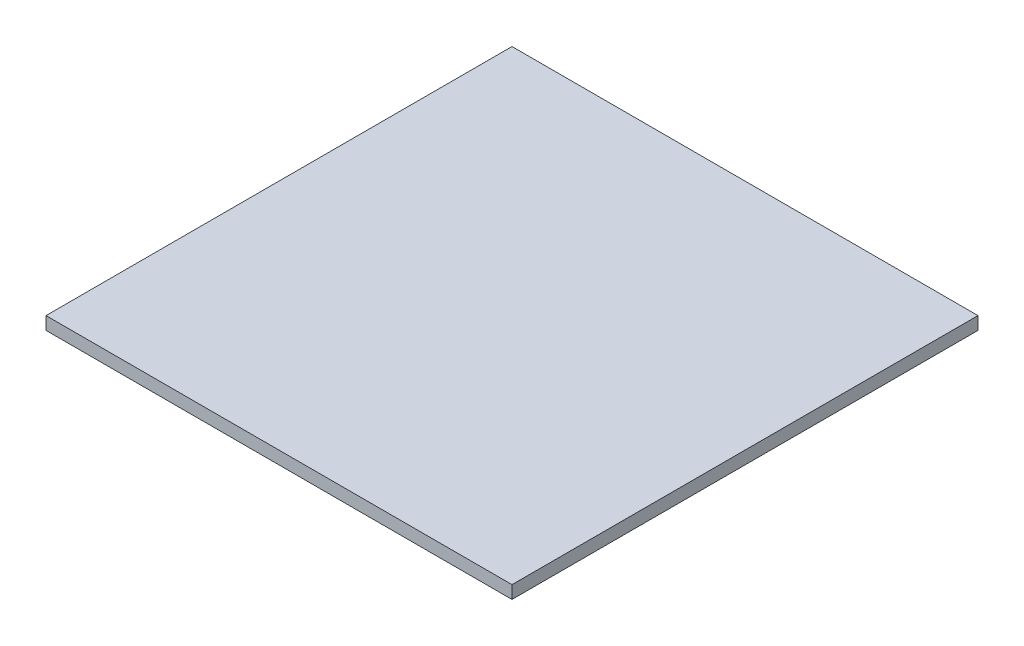
ISO-10303-21;
HEADER;
FILE_DESCRIPTION(('STEP AP214'),'2;1');
FILE_NAME('part.step','',(''),(''),'','','');
FILE_SCHEMA(('AUTOMOTIVE_DESIGN { 1 0 10303 214 1 1 1 1 }'));
ENDSEC;
DATA;
#1=APPLICATION_CONTEXT('core data for automotive mechanical design processes');
#2=APPLICATION_PROTOCOL_DEFINITION('international standard','automotive_design',2000,#1);
#3=PRODUCT_CONTEXT('',#1,'mechanical');
#4=PRODUCT('Part','Part','',(#3));
#5=PRODUCT_RELATED_PRODUCT_CATEGORY('part','',(#4));
#6=PRODUCT_DEFINITION_FORMATION('','',#4);
#7=PRODUCT_DEFINITION_CONTEXT('part definition',#1,'design');
#8=PRODUCT_DEFINITION('design','',#6,#7);
#9=PRODUCT_DEFINITION_SHAPE('','',#8);
#10=(LENGTH_UNIT() NAMED_UNIT(*) SI_UNIT(.MILLI.,.METRE.));
#11=(NAMED_UNIT(*) PLANE_ANGLE_UNIT() SI_UNIT($,.RADIAN.));
#12=(NAMED_UNIT(*) SI_UNIT($,.STERADIAN.) SOLID_ANGLE_UNIT());
#13=UNCERTAINTY_MEASURE_WITH_UNIT(LENGTH_MEASURE(1.E-05),#10,'distance_accuracy_value','');
#14=(GEOMETRIC_REPRESENTATION_CONTEXT(3) GLOBAL_UNCERTAINTY_ASSIGNED_CONTEXT((#13)) GLOBAL_UNIT_ASSIGNED_CONTEXT((#10,
#11,#12)) REPRESENTATION_CONTEXT('',''));
#15=CARTESIAN_POINT('',(0.,0.,0.));
#16=DIRECTION('',(0.,0.,1.));
#17=DIRECTION('',(1.,0.,0.));
#18=AXIS2_PLACEMENT_3D('',#15,#16,#17);
#19=CARTESIAN_POINT('',(215.9,11.90625,215.9));
#20=DIRECTION('',(-1.,0.,0.));
#21=DIRECTION('',(0.,0.,1.));
#22=AXIS2_PLACEMENT_3D('',#19,#20,#21);
#23=PLANE('',#22);
#24=DIRECTION('',(0.,0.,-1.));
#25=VECTOR('',#24,1.);
#26=CARTESIAN_POINT('',(215.9,0.,215.9));
#27=LINE('',#26,#25);
#28=CARTESIAN_POINT('',(215.9,0.,215.9));
#29=VERTEX_POINT('',#28);
#30=CARTESIAN_POINT('',(215.9,0.,-215.9));
#31=VERTEX_POINT('',#30);
#32=EDGE_CURVE('E96',#29,#31,#27,.T.);
#33=ORIENTED_EDGE('',*,*,#32,.T.);
#34=DIRECTION('',(0.,-1.,0.));
#35=VECTOR('',#34,1.);
#36=CARTESIAN_POINT('',(215.9,11.90625,-215.9));
#37=LINE('',#36,#35);
#38=CARTESIAN_POINT('',(215.9,11.90625,-215.9));
#39=VERTEX_POINT('',#38);
#40=EDGE_CURVE('E11',#39,#31,#37,.T.);
#41=ORIENTED_EDGE('',*,*,#40,.F.);
#42=DIRECTION('',(0.,0.,-1.));
#43=VECTOR('',#42,1.);
#44=CARTESIAN_POINT('',(215.9,11.90625,215.9));
#45=LINE('',#44,#43);
#46=CARTESIAN_POINT('',(215.9,11.90625,215.9));
#47=VERTEX_POINT('',#46);
#48=EDGE_CURVE('E84',#47,#39,#45,.T.);
#49=ORIENTED_EDGE('',*,*,#48,.F.);
#50=DIRECTION('',(0.,-1.,0.));
#51=VECTOR('',#50,1.);
#52=CARTESIAN_POINT('',(215.9,11.90625,215.9));
#53=LINE('',#52,#51);
#54=EDGE_CURVE('E92',#47,#29,#53,.T.);
#55=ORIENTED_EDGE('',*,*,#54,.T.);
#56=EDGE_LOOP('',(#33,#41,#49,#55));
#57=FACE_BOUND('',#56,.T.);
#58=ADVANCED_FACE('F33',(#57),#23,.F.);
#59=CARTESIAN_POINT('',(-215.9,11.90625,-215.9));
#60=DIRECTION('',(0.,0.,1.));
#61=DIRECTION('',(1.,0.,0.));
#62=AXIS2_PLACEMENT_3D('',#59,#60,#61);
#63=PLANE('',#62);
#64=DIRECTION('',(-1.,0.,0.));
#65=VECTOR('',#64,1.);
#66=CARTESIAN_POINT('',(-215.9,0.,-215.9));
#67=LINE('',#66,#65);
#68=CARTESIAN_POINT('',(-215.9,0.,-215.9));
#69=VERTEX_POINT('',#68);
#70=EDGE_CURVE('E88',#31,#69,#67,.T.);
#71=ORIENTED_EDGE('',*,*,#70,.T.);
#72=DIRECTION('',(0.,-1.,0.));
#73=VECTOR('',#72,1.);
#74=CARTESIAN_POINT('',(-215.9,11.90625,-215.9));
#75=LINE('',#74,#73);
#76=CARTESIAN_POINT('',(-215.9,11.90625,-215.9));
#77=VERTEX_POINT('',#76);
#78=EDGE_CURVE('E41',#77,#69,#75,.T.);
#79=ORIENTED_EDGE('',*,*,#78,.F.);
#80=DIRECTION('',(-1.,0.,0.));
#81=VECTOR('',#80,1.);
#82=CARTESIAN_POINT('',(-215.9,11.90625,-215.9));
#83=LINE('',#82,#81);
#84=EDGE_CURVE('E79',#39,#77,#83,.T.);
#85=ORIENTED_EDGE('',*,*,#84,.F.);
#86=ORIENTED_EDGE('',*,*,#40,.T.);
#87=EDGE_LOOP('',(#71,#79,#85,#86));
#88=FACE_BOUND('',#87,.T.);
#89=ADVANCED_FACE('F87',(#88),#63,.F.);
#90=CARTESIAN_POINT('',(-215.9,11.90625,215.9));
#91=DIRECTION('',(1.,0.,0.));
#92=DIRECTION('',(0.,0.,-1.));
#93=AXIS2_PLACEMENT_3D('',#90,#91,#92);
#94=PLANE('',#93);
#95=DIRECTION('',(0.,0.,1.));
#96=VECTOR('',#95,1.);
#97=CARTESIAN_POINT('',(-215.9,0.,215.9));
#98=LINE('',#97,#96);
#99=CARTESIAN_POINT('',(-215.9,0.,215.9));
#100=VERTEX_POINT('',#99);
#101=EDGE_CURVE('E66',#69,#100,#98,.T.);
#102=ORIENTED_EDGE('',*,*,#101,.T.);
#103=DIRECTION('',(0.,-1.,0.));
#104=VECTOR('',#103,1.);
#105=CARTESIAN_POINT('',(-215.9,11.90625,215.9));
#106=LINE('',#105,#104);
#107=CARTESIAN_POINT('',(-215.9,11.90625,215.9));
#108=VERTEX_POINT('',#107);
#109=EDGE_CURVE('E89',#108,#100,#106,.T.);
#110=ORIENTED_EDGE('',*,*,#109,.F.);
#111=DIRECTION('',(0.,0.,1.));
#112=VECTOR('',#111,1.);
#113=CARTESIAN_POINT('',(-215.9,11.90625,215.9));
#114=LINE('',#113,#112);
#115=EDGE_CURVE('E82',#77,#108,#114,.T.);
#116=ORIENTED_EDGE('',*,*,#115,.F.);
#117=ORIENTED_EDGE('',*,*,#78,.T.);
#118=EDGE_LOOP('',(#102,#110,#116,#117));
#119=FACE_BOUND('',#118,.T.);
#120=ADVANCED_FACE('F90',(#119),#94,.F.);
#121=CARTESIAN_POINT('',(-215.9,11.90625,215.9));
#122=DIRECTION('',(0.,0.,-1.));
#123=DIRECTION('',(-1.,0.,0.));
#124=AXIS2_PLACEMENT_3D('',#121,#122,#123);
#125=PLANE('',#124);
#126=DIRECTION('',(1.,0.,0.));
#127=VECTOR('',#126,1.);
#128=CARTESIAN_POINT('',(-215.9,0.,215.9));
#129=LINE('',#128,#127);
#130=EDGE_CURVE('E72',#100,#29,#129,.T.);
#131=ORIENTED_EDGE('',*,*,#130,.T.);
#132=ORIENTED_EDGE('',*,*,#54,.F.);
#133=DIRECTION('',(1.,0.,0.));
#134=VECTOR('',#133,1.);
#135=CARTESIAN_POINT('',(-215.9,11.90625,215.9));
#136=LINE('',#135,#134);
#137=EDGE_CURVE('E49',#108,#47,#136,.T.);
#138=ORIENTED_EDGE('',*,*,#137,.F.);
#139=ORIENTED_EDGE('',*,*,#109,.T.);
#140=EDGE_LOOP('',(#131,#132,#138,#139));
#141=FACE_BOUND('',#140,.T.);
#142=ADVANCED_FACE('F103',(#141),#125,.F.);
#143=CARTESIAN_POINT('',(0.,11.90625,0.));
#144=DIRECTION('',(0.,-1.,0.));
#145=DIRECTION('',(0.,0.,-1.));
#146=AXIS2_PLACEMENT_3D('',#143,#144,#145);
#147=PLANE('',#146);
#148=ORIENTED_EDGE('',*,*,#48,.T.);
#149=ORIENTED_EDGE('',*,*,#84,.T.);
#150=ORIENTED_EDGE('',*,*,#115,.T.);
#151=ORIENTED_EDGE('',*,*,#137,.T.);
#152=EDGE_LOOP('',(#148,#149,#150,#151));
#153=FACE_BOUND('',#152,.T.);
#154=ADVANCED_FACE('F80',(#153),#147,.F.);
#155=CARTESIAN_POINT('',(0.,0.,0.));
#156=DIRECTION('',(0.,-1.,0.));
#157=DIRECTION('',(0.,0.,-1.));
#158=AXIS2_PLACEMENT_3D('',#155,#156,#157);
#159=PLANE('',#158);
#160=ORIENTED_EDGE('',*,*,#32,.F.);
#161=ORIENTED_EDGE('',*,*,#130,.F.);
#162=ORIENTED_EDGE('',*,*,#101,.F.);
#163=ORIENTED_EDGE('',*,*,#70,.F.);
#164=EDGE_LOOP('',(#160,#161,#162,#163));
#165=FACE_BOUND('',#164,.T.);
#166=ADVANCED_FACE('F106',(#165),#159,.T.);
#167=CLOSED_SHELL('',(#58,#89,#120,#142,#154,#166));
#168=MANIFOLD_SOLID_BREP('B2',#167);
#169=ADVANCED_BREP_SHAPE_REPRESENTATION('',(#18,#168),#14);
#170=SHAPE_DEFINITION_REPRESENTATION(#9,#169);
ENDSEC;
END-ISO-10303-21;
